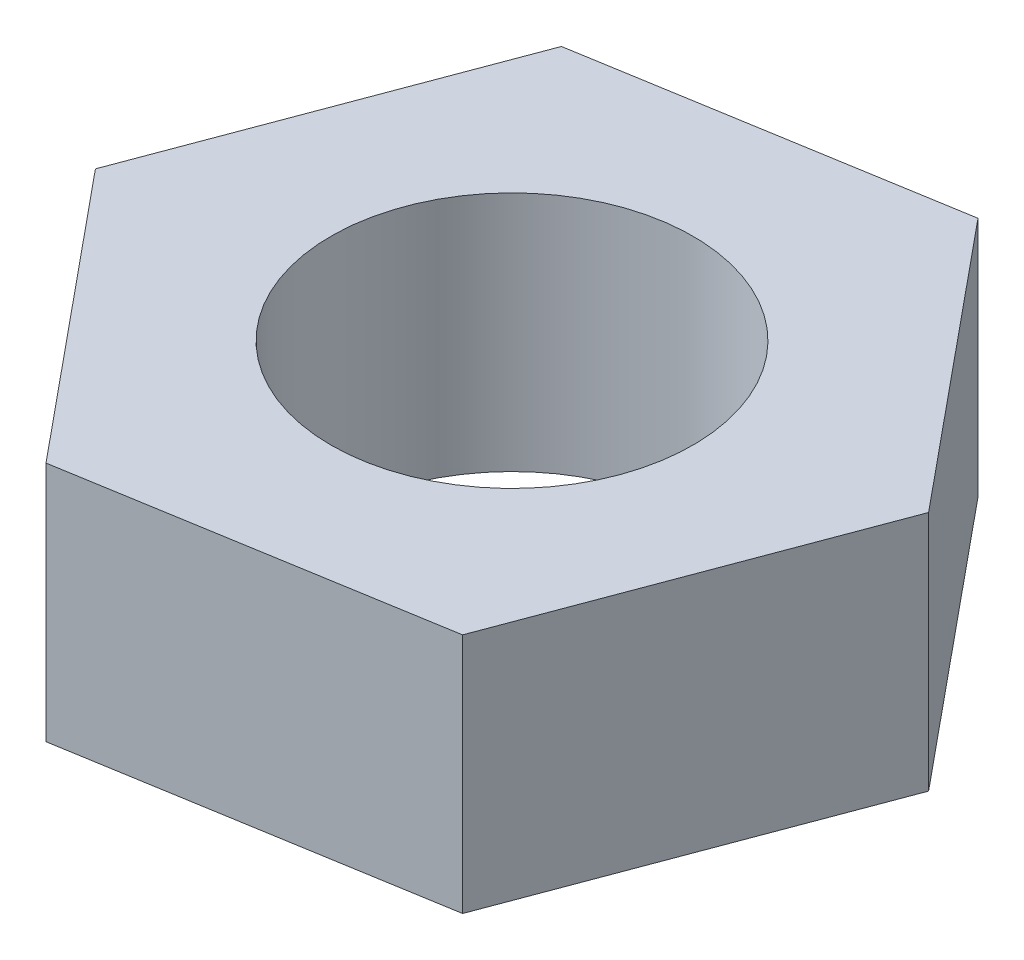
ISO-10303-21;
HEADER;
FILE_DESCRIPTION(('STEP AP214'),'2;1');
FILE_NAME('part.step','',(''),(''),'','','');
FILE_SCHEMA(('AUTOMOTIVE_DESIGN { 1 0 10303 214 1 1 1 1 }'));
ENDSEC;
DATA;
#1=APPLICATION_CONTEXT('core data for automotive mechanical design processes');
#2=APPLICATION_PROTOCOL_DEFINITION('international standard','automotive_design',2000,#1);
#3=PRODUCT_CONTEXT('',#1,'mechanical');
#4=PRODUCT('Part','Part','',(#3));
#5=PRODUCT_RELATED_PRODUCT_CATEGORY('part','',(#4));
#6=PRODUCT_DEFINITION_FORMATION('','',#4);
#7=PRODUCT_DEFINITION_CONTEXT('part definition',#1,'design');
#8=PRODUCT_DEFINITION('design','',#6,#7);
#9=PRODUCT_DEFINITION_SHAPE('','',#8);
#10=(LENGTH_UNIT() NAMED_UNIT(*) SI_UNIT(.MILLI.,.METRE.));
#11=(NAMED_UNIT(*) PLANE_ANGLE_UNIT() SI_UNIT($,.RADIAN.));
#12=(NAMED_UNIT(*) SI_UNIT($,.STERADIAN.) SOLID_ANGLE_UNIT());
#13=UNCERTAINTY_MEASURE_WITH_UNIT(LENGTH_MEASURE(1.E-05),#10,'distance_accuracy_value','');
#14=(GEOMETRIC_REPRESENTATION_CONTEXT(3) GLOBAL_UNCERTAINTY_ASSIGNED_CONTEXT((#13)) GLOBAL_UNIT_ASSIGNED_CONTEXT((#10,
#11,#12)) REPRESENTATION_CONTEXT('',''));
#15=CARTESIAN_POINT('',(0.,0.,0.));
#16=DIRECTION('',(0.,0.,1.));
#17=DIRECTION('',(1.,0.,0.));
#18=AXIS2_PLACEMENT_3D('',#15,#16,#17);
#19=CARTESIAN_POINT('',(0.,2.,0.));
#20=DIRECTION('',(0.,1.,0.));
#21=DIRECTION('',(0.,0.,1.));
#22=AXIS2_PLACEMENT_3D('',#19,#20,#21);
#23=PLANE('',#22);
#24=DIRECTION('',(0.350823262553191,0.,-0.93644168982993));
#25=VECTOR('',#24,1.);
#26=CARTESIAN_POINT('',(1.90671198383686,2.,2.3161281075737));
#27=LINE('',#26,#25);
#28=CARTESIAN_POINT('',(1.90671198383686,2.,2.3161281075737));
#29=VERTEX_POINT('',#28);
#30=CARTESIAN_POINT('',(2.95918177149643,2.,-0.493196961916091));
#31=VERTEX_POINT('',#30);
#32=EDGE_CURVE('E131',#29,#31,#27,.T.);
#33=ORIENTED_EDGE('',*,*,#32,.T.);
#34=DIRECTION('',(-0.635570661278952,0.,-0.772042702524566));
#35=VECTOR('',#34,1.);
#36=CARTESIAN_POINT('',(2.95918177149643,2.,-0.493196961916091));
#37=LINE('',#36,#35);
#38=CARTESIAN_POINT('',(1.05246978765957,2.,-2.80932506948979));
#39=VERTEX_POINT('',#38);
#40=EDGE_CURVE('E89',#31,#39,#37,.T.);
#41=ORIENTED_EDGE('',*,*,#40,.T.);
#42=DIRECTION('',(-0.986393923832143,0.,0.164398987305363));
#43=VECTOR('',#42,1.);
#44=CARTESIAN_POINT('',(1.05246978765957,2.,-2.80932506948979));
#45=LINE('',#44,#43);
#46=CARTESIAN_POINT('',(-1.90671198383685,2.,-2.3161281075737));
#47=VERTEX_POINT('',#46);
#48=EDGE_CURVE('E102',#39,#47,#45,.T.);
#49=ORIENTED_EDGE('',*,*,#48,.T.);
#50=DIRECTION('',(-0.350823262553191,0.,0.93644168982993));
#51=VECTOR('',#50,1.);
#52=CARTESIAN_POINT('',(-1.90671198383685,2.,-2.3161281075737));
#53=LINE('',#52,#51);
#54=CARTESIAN_POINT('',(-2.95918177149643,2.,0.49319696191609));
#55=VERTEX_POINT('',#54);
#56=EDGE_CURVE('E96',#47,#55,#53,.T.);
#57=ORIENTED_EDGE('',*,*,#56,.T.);
#58=DIRECTION('',(0.635570661278952,0.,0.772042702524567));
#59=VECTOR('',#58,1.);
#60=CARTESIAN_POINT('',(-2.95918177149643,2.,0.49319696191609));
#61=LINE('',#60,#59);
#62=CARTESIAN_POINT('',(-1.05246978765957,2.,2.80932506948979));
#63=VERTEX_POINT('',#62);
#64=EDGE_CURVE('E100',#55,#63,#61,.T.);
#65=ORIENTED_EDGE('',*,*,#64,.T.);
#66=DIRECTION('',(0.986393923832143,0.,-0.164398987305363));
#67=VECTOR('',#66,1.);
#68=CARTESIAN_POINT('',(-1.05246978765957,2.,2.80932506948979));
#69=LINE('',#68,#67);
#70=EDGE_CURVE('E52',#63,#29,#69,.T.);
#71=ORIENTED_EDGE('',*,*,#70,.T.);
#72=EDGE_LOOP('',(#33,#41,#49,#57,#65,#71));
#73=FACE_BOUND('',#72,.T.);
#74=CARTESIAN_POINT('',(0.,2.,0.));
#75=DIRECTION('',(0.,1.,0.));
#76=DIRECTION('',(0.,0.,1.));
#77=AXIS2_PLACEMENT_3D('',#74,#75,#76);
#78=CIRCLE('',#77,1.5);
#79=CARTESIAN_POINT('',(0.,2.,1.5));
#80=VERTEX_POINT('',#79);
#81=EDGE_CURVE('E124',#80,#80,#78,.T.);
#82=ORIENTED_EDGE('',*,*,#81,.F.);
#83=EDGE_LOOP('',(#82));
#84=FACE_BOUND('',#83,.T.);
#85=ADVANCED_FACE('F35',(#73,#84),#23,.T.);
#86=CARTESIAN_POINT('',(0.,0.,0.));
#87=DIRECTION('',(0.,1.,0.));
#88=DIRECTION('',(0.,0.,1.));
#89=AXIS2_PLACEMENT_3D('',#86,#87,#88);
#90=PLANE('',#89);
#91=DIRECTION('',(0.350823262553191,0.,-0.93644168982993));
#92=VECTOR('',#91,1.);
#93=CARTESIAN_POINT('',(1.90671198383686,0.,2.3161281075737));
#94=LINE('',#93,#92);
#95=CARTESIAN_POINT('',(1.90671198383686,0.,2.3161281075737));
#96=VERTEX_POINT('',#95);
#97=CARTESIAN_POINT('',(2.95918177149643,0.,-0.493196961916091));
#98=VERTEX_POINT('',#97);
#99=EDGE_CURVE('E120',#96,#98,#94,.T.);
#100=ORIENTED_EDGE('',*,*,#99,.F.);
#101=DIRECTION('',(0.986393923832143,0.,-0.164398987305363));
#102=VECTOR('',#101,1.);
#103=CARTESIAN_POINT('',(-1.05246978765957,0.,2.80932506948979));
#104=LINE('',#103,#102);
#105=CARTESIAN_POINT('',(-1.05246978765957,0.,2.80932506948979));
#106=VERTEX_POINT('',#105);
#107=EDGE_CURVE('E81',#106,#96,#104,.T.);
#108=ORIENTED_EDGE('',*,*,#107,.F.);
#109=DIRECTION('',(0.635570661278952,0.,0.772042702524567));
#110=VECTOR('',#109,1.);
#111=CARTESIAN_POINT('',(-2.95918177149643,0.,0.49319696191609));
#112=LINE('',#111,#110);
#113=CARTESIAN_POINT('',(-2.95918177149643,0.,0.49319696191609));
#114=VERTEX_POINT('',#113);
#115=EDGE_CURVE('E75',#114,#106,#112,.T.);
#116=ORIENTED_EDGE('',*,*,#115,.F.);
#117=DIRECTION('',(-0.350823262553191,0.,0.93644168982993));
#118=VECTOR('',#117,1.);
#119=CARTESIAN_POINT('',(-1.90671198383685,0.,-2.3161281075737));
#120=LINE('',#119,#118);
#121=CARTESIAN_POINT('',(-1.90671198383685,0.,-2.3161281075737));
#122=VERTEX_POINT('',#121);
#123=EDGE_CURVE('E110',#122,#114,#120,.T.);
#124=ORIENTED_EDGE('',*,*,#123,.F.);
#125=DIRECTION('',(-0.986393923832143,0.,0.164398987305363));
#126=VECTOR('',#125,1.);
#127=CARTESIAN_POINT('',(1.05246978765957,0.,-2.80932506948979));
#128=LINE('',#127,#126);
#129=CARTESIAN_POINT('',(1.05246978765957,0.,-2.80932506948979));
#130=VERTEX_POINT('',#129);
#131=EDGE_CURVE('E126',#130,#122,#128,.T.);
#132=ORIENTED_EDGE('',*,*,#131,.F.);
#133=DIRECTION('',(-0.635570661278952,0.,-0.772042702524566));
#134=VECTOR('',#133,1.);
#135=CARTESIAN_POINT('',(2.95918177149643,0.,-0.493196961916091));
#136=LINE('',#135,#134);
#137=EDGE_CURVE('E123',#98,#130,#136,.T.);
#138=ORIENTED_EDGE('',*,*,#137,.F.);
#139=EDGE_LOOP('',(#100,#108,#116,#124,#132,#138));
#140=FACE_BOUND('',#139,.T.);
#141=CARTESIAN_POINT('',(0.,0.,0.));
#142=DIRECTION('',(0.,1.,0.));
#143=DIRECTION('',(0.,0.,1.));
#144=AXIS2_PLACEMENT_3D('',#141,#142,#143);
#145=CIRCLE('',#144,1.5);
#146=CARTESIAN_POINT('',(0.,0.,1.5));
#147=VERTEX_POINT('',#146);
#148=EDGE_CURVE('E236',#147,#147,#145,.T.);
#149=ORIENTED_EDGE('',*,*,#148,.T.);
#150=EDGE_LOOP('',(#149));
#151=FACE_BOUND('',#150,.T.);
#152=ADVANCED_FACE('F140',(#140,#151),#90,.F.);
#153=CARTESIAN_POINT('',(1.90671198383686,2.,2.3161281075737));
#154=DIRECTION('',(-0.93644168982993,0.,-0.350823262553191));
#155=DIRECTION('',(-0.350823262553191,0.,0.93644168982993));
#156=AXIS2_PLACEMENT_3D('',#153,#154,#155);
#157=PLANE('',#156);
#158=ORIENTED_EDGE('',*,*,#99,.T.);
#159=DIRECTION('',(0.,-1.,0.));
#160=VECTOR('',#159,1.);
#161=CARTESIAN_POINT('',(2.95918177149643,2.,-0.493196961916091));
#162=LINE('',#161,#160);
#163=EDGE_CURVE('E11',#31,#98,#162,.T.);
#164=ORIENTED_EDGE('',*,*,#163,.F.);
#165=ORIENTED_EDGE('',*,*,#32,.F.);
#166=DIRECTION('',(0.,-1.,0.));
#167=VECTOR('',#166,1.);
#168=CARTESIAN_POINT('',(1.90671198383686,2.,2.3161281075737));
#169=LINE('',#168,#167);
#170=EDGE_CURVE('E116',#29,#96,#169,.T.);
#171=ORIENTED_EDGE('',*,*,#170,.T.);
#172=EDGE_LOOP('',(#158,#164,#165,#171));
#173=FACE_BOUND('',#172,.T.);
#174=ADVANCED_FACE('F37',(#173),#157,.F.);
#175=CARTESIAN_POINT('',(2.95918177149643,2.,-0.493196961916091));
#176=DIRECTION('',(-0.772042702524566,0.,0.635570661278952));
#177=DIRECTION('',(0.635570661278952,0.,0.772042702524566));
#178=AXIS2_PLACEMENT_3D('',#175,#176,#177);
#179=PLANE('',#178);
#180=ORIENTED_EDGE('',*,*,#137,.T.);
#181=DIRECTION('',(0.,-1.,0.));
#182=VECTOR('',#181,1.);
#183=CARTESIAN_POINT('',(1.05246978765957,2.,-2.80932506948979));
#184=LINE('',#183,#182);
#185=EDGE_CURVE('E44',#39,#130,#184,.T.);
#186=ORIENTED_EDGE('',*,*,#185,.F.);
#187=ORIENTED_EDGE('',*,*,#40,.F.);
#188=ORIENTED_EDGE('',*,*,#163,.T.);
#189=EDGE_LOOP('',(#180,#186,#187,#188));
#190=FACE_BOUND('',#189,.T.);
#191=ADVANCED_FACE('F165',(#190),#179,.F.);
#192=CARTESIAN_POINT('',(1.05246978765957,2.,-2.80932506948979));
#193=DIRECTION('',(0.164398987305363,0.,0.986393923832143));
#194=DIRECTION('',(0.986393923832143,0.,-0.164398987305363));
#195=AXIS2_PLACEMENT_3D('',#192,#193,#194);
#196=PLANE('',#195);
#197=ORIENTED_EDGE('',*,*,#131,.T.);
#198=DIRECTION('',(0.,-1.,0.));
#199=VECTOR('',#198,1.);
#200=CARTESIAN_POINT('',(-1.90671198383685,2.,-2.3161281075737));
#201=LINE('',#200,#199);
#202=EDGE_CURVE('E111',#47,#122,#201,.T.);
#203=ORIENTED_EDGE('',*,*,#202,.F.);
#204=ORIENTED_EDGE('',*,*,#48,.F.);
#205=ORIENTED_EDGE('',*,*,#185,.T.);
#206=EDGE_LOOP('',(#197,#203,#204,#205));
#207=FACE_BOUND('',#206,.T.);
#208=ADVANCED_FACE('F137',(#207),#196,.F.);
#209=CARTESIAN_POINT('',(-1.90671198383685,2.,-2.3161281075737));
#210=DIRECTION('',(0.93644168982993,0.,0.350823262553191));
#211=DIRECTION('',(0.350823262553191,0.,-0.93644168982993));
#212=AXIS2_PLACEMENT_3D('',#209,#210,#211);
#213=PLANE('',#212);
#214=ORIENTED_EDGE('',*,*,#123,.T.);
#215=DIRECTION('',(0.,-1.,0.));
#216=VECTOR('',#215,1.);
#217=CARTESIAN_POINT('',(-2.95918177149643,2.,0.49319696191609));
#218=LINE('',#217,#216);
#219=EDGE_CURVE('E107',#55,#114,#218,.T.);
#220=ORIENTED_EDGE('',*,*,#219,.F.);
#221=ORIENTED_EDGE('',*,*,#56,.F.);
#222=ORIENTED_EDGE('',*,*,#202,.T.);
#223=EDGE_LOOP('',(#214,#220,#221,#222));
#224=FACE_BOUND('',#223,.T.);
#225=ADVANCED_FACE('F108',(#224),#213,.F.);
#226=CARTESIAN_POINT('',(-2.95918177149643,2.,0.49319696191609));
#227=DIRECTION('',(0.772042702524567,0.,-0.635570661278952));
#228=DIRECTION('',(-0.635570661278952,0.,-0.772042702524567));
#229=AXIS2_PLACEMENT_3D('',#226,#227,#228);
#230=PLANE('',#229);
#231=ORIENTED_EDGE('',*,*,#115,.T.);
#232=DIRECTION('',(0.,-1.,0.));
#233=VECTOR('',#232,1.);
#234=CARTESIAN_POINT('',(-1.05246978765957,2.,2.80932506948979));
#235=LINE('',#234,#233);
#236=EDGE_CURVE('E112',#63,#106,#235,.T.);
#237=ORIENTED_EDGE('',*,*,#236,.F.);
#238=ORIENTED_EDGE('',*,*,#64,.F.);
#239=ORIENTED_EDGE('',*,*,#219,.T.);
#240=EDGE_LOOP('',(#231,#237,#238,#239));
#241=FACE_BOUND('',#240,.T.);
#242=ADVANCED_FACE('F114',(#241),#230,.F.);
#243=CARTESIAN_POINT('',(-1.05246978765957,2.,2.80932506948979));
#244=DIRECTION('',(-0.164398987305363,0.,-0.986393923832143));
#245=DIRECTION('',(-0.986393923832143,0.,0.164398987305363));
#246=AXIS2_PLACEMENT_3D('',#243,#244,#245);
#247=PLANE('',#246);
#248=ORIENTED_EDGE('',*,*,#107,.T.);
#249=ORIENTED_EDGE('',*,*,#170,.F.);
#250=ORIENTED_EDGE('',*,*,#70,.F.);
#251=ORIENTED_EDGE('',*,*,#236,.T.);
#252=EDGE_LOOP('',(#248,#249,#250,#251));
#253=FACE_BOUND('',#252,.T.);
#254=ADVANCED_FACE('F145',(#253),#247,.F.);
#255=CARTESIAN_POINT('',(0.,2.,0.));
#256=DIRECTION('',(0.,-1.,0.));
#257=DIRECTION('',(0.,0.,-1.));
#258=AXIS2_PLACEMENT_3D('',#255,#256,#257);
#259=CYLINDRICAL_SURFACE('',#258,1.5);
#260=ORIENTED_EDGE('',*,*,#81,.T.);
#261=EDGE_LOOP('',(#260));
#262=FACE_BOUND('',#261,.T.);
#263=ORIENTED_EDGE('',*,*,#148,.F.);
#264=EDGE_LOOP('',(#263));
#265=FACE_BOUND('',#264,.T.);
#266=ADVANCED_FACE('F147',(#262,#265),#259,.F.);
#267=CLOSED_SHELL('',(#85,#152,#174,#191,#208,#225,#242,#254,#266));
#268=MANIFOLD_SOLID_BREP('B2',#267);
#269=ADVANCED_BREP_SHAPE_REPRESENTATION('',(#18,#268),#14);
#270=SHAPE_DEFINITION_REPRESENTATION(#9,#269);
ENDSEC;
END-ISO-10303-21;
